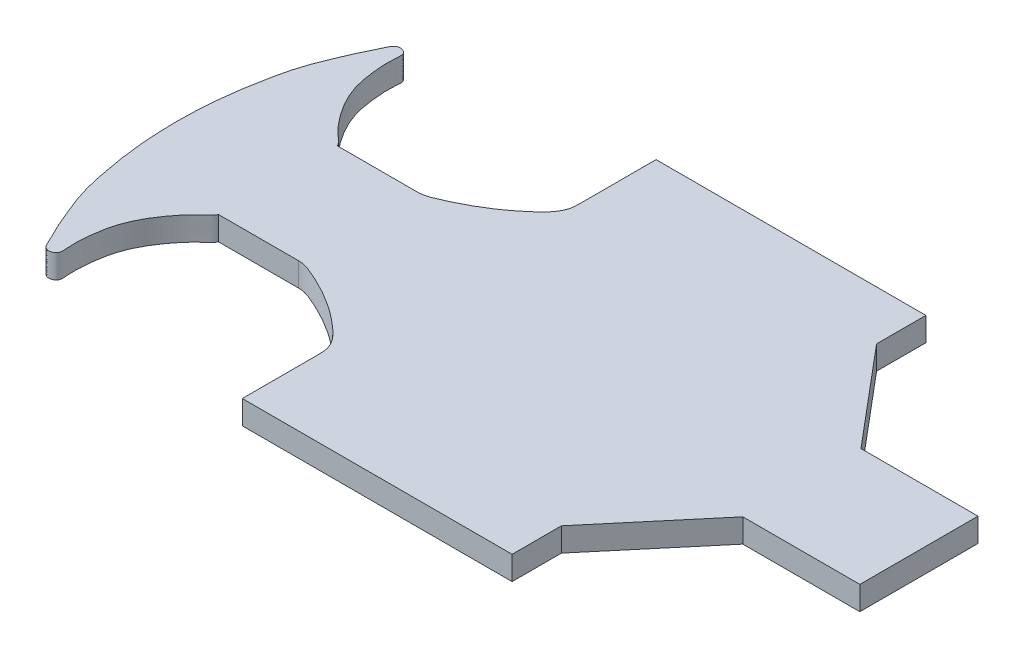
ISO-10303-21;
HEADER;
FILE_DESCRIPTION(('STEP AP214'),'2;1');
FILE_NAME('part.step','',(''),(''),'','','');
FILE_SCHEMA(('AUTOMOTIVE_DESIGN { 1 0 10303 214 1 1 1 1 }'));
ENDSEC;
DATA;
#1=APPLICATION_CONTEXT('core data for automotive mechanical design processes');
#2=APPLICATION_PROTOCOL_DEFINITION('international standard','automotive_design',2000,#1);
#3=PRODUCT_CONTEXT('',#1,'mechanical');
#4=PRODUCT('Part','Part','',(#3));
#5=PRODUCT_RELATED_PRODUCT_CATEGORY('part','',(#4));
#6=PRODUCT_DEFINITION_FORMATION('','',#4);
#7=PRODUCT_DEFINITION_CONTEXT('part definition',#1,'design');
#8=PRODUCT_DEFINITION('design','',#6,#7);
#9=PRODUCT_DEFINITION_SHAPE('','',#8);
#10=(LENGTH_UNIT() NAMED_UNIT(*) SI_UNIT(.MILLI.,.METRE.));
#11=(NAMED_UNIT(*) PLANE_ANGLE_UNIT() SI_UNIT($,.RADIAN.));
#12=(NAMED_UNIT(*) SI_UNIT($,.STERADIAN.) SOLID_ANGLE_UNIT());
#13=UNCERTAINTY_MEASURE_WITH_UNIT(LENGTH_MEASURE(1.E-05),#10,'distance_accuracy_value','');
#14=(GEOMETRIC_REPRESENTATION_CONTEXT(3) GLOBAL_UNCERTAINTY_ASSIGNED_CONTEXT((#13)) GLOBAL_UNIT_ASSIGNED_CONTEXT((#10,
#11,#12)) REPRESENTATION_CONTEXT('',''));
#15=CARTESIAN_POINT('',(0.,0.,0.));
#16=DIRECTION('',(0.,0.,1.));
#17=DIRECTION('',(1.,0.,0.));
#18=AXIS2_PLACEMENT_3D('',#15,#16,#17);
#19=CARTESIAN_POINT('',(115.068930171489,10.,-83.5105271816987));
#20=CARTESIAN_POINT('',(115.068930171489,10.,-85.4523260025491));
#21=CARTESIAN_POINT('',(115.147023327499,10.,-89.2239037065916));
#22=CARTESIAN_POINT('',(111.903352503153,10.,-94.3936841806615));
#23=CARTESIAN_POINT('',(106.742467778179,10.,-99.0321688142349));
#24=CARTESIAN_POINT('',(97.8943490032046,10.,-106.039765726452));
#25=CARTESIAN_POINT('',(87.4355017362749,10.,-111.618593277351));
#26=CARTESIAN_POINT('',(79.2126361652634,10.,-114.920441654248));
#27=CARTESIAN_POINT('',(76.4993979676328,10.,-114.920441654248));
#28=B_SPLINE_CURVE_WITH_KNOTS('',3,(#19,#20,#21,#22,#23,#24,#25,#26,#27),.UNSPECIFIED.,.F.,.F.,
(4,1,1,1,1,1,4),(0.,0.105978477751694,0.213108663044497,0.330387254989374,0.501050906937181,
0.851333825241986,1.),.UNSPECIFIED.);
#29=DIRECTION('',(0.,-1.,0.));
#30=VECTOR('',#29,1.);
#31=SURFACE_OF_LINEAR_EXTRUSION('',#28,#30);
#32=CARTESIAN_POINT('',(115.068930171489,0.,-83.5105271816987));
#33=CARTESIAN_POINT('',(115.068930171489,0.,-85.4523260025491));
#34=CARTESIAN_POINT('',(115.147023327499,0.,-89.2239037065916));
#35=CARTESIAN_POINT('',(111.903352503153,0.,-94.3936841806615));
#36=CARTESIAN_POINT('',(106.742467778179,0.,-99.0321688142349));
#37=CARTESIAN_POINT('',(97.8943490032046,0.,-106.039765726452));
#38=CARTESIAN_POINT('',(87.4355017362749,0.,-111.618593277351));
#39=CARTESIAN_POINT('',(79.2126361652634,0.,-114.920441654248));
#40=CARTESIAN_POINT('',(76.4993979676328,0.,-114.920441654248));
#41=B_SPLINE_CURVE_WITH_KNOTS('',3,(#32,#33,#34,#35,#36,#37,#38,#39,#40),.UNSPECIFIED.,.F.,.F.,
(4,1,1,1,1,1,4),(0.,0.105978477751694,0.213108663044497,0.330387254989374,0.501050906937181,
0.851333825241986,1.),.UNSPECIFIED.);
#42=CARTESIAN_POINT('',(115.068930171489,0.,-83.5105271816987));
#43=VERTEX_POINT('',#42);
#44=CARTESIAN_POINT('',(76.4993979676328,0.,-114.920441654248));
#45=VERTEX_POINT('',#44);
#46=EDGE_CURVE('E302',#43,#45,#41,.T.);
#47=ORIENTED_EDGE('',*,*,#46,.F.);
#48=DIRECTION('',(0.,-1.,0.));
#49=VECTOR('',#48,1.);
#50=CARTESIAN_POINT('',(115.068930171489,10.,-83.5105271816987));
#51=LINE('',#50,#49);
#52=CARTESIAN_POINT('',(115.068930171489,10.,-83.5105271816987));
#53=VERTEX_POINT('',#52);
#54=EDGE_CURVE('E11',#53,#43,#51,.T.);
#55=ORIENTED_EDGE('',*,*,#54,.F.);
#56=CARTESIAN_POINT('',(76.4993979676328,10.,-114.920441654248));
#57=VERTEX_POINT('',#56);
#58=EDGE_CURVE('E361',#53,#57,#28,.T.);
#59=ORIENTED_EDGE('',*,*,#58,.T.);
#60=DIRECTION('',(0.,-1.,0.));
#61=VECTOR('',#60,1.);
#62=CARTESIAN_POINT('',(76.4993979676328,10.,-114.920441654248));
#63=LINE('',#62,#61);
#64=EDGE_CURVE('E118',#57,#45,#63,.T.);
#65=ORIENTED_EDGE('',*,*,#64,.T.);
#66=EDGE_LOOP('',(#47,#55,#59,#65));
#67=FACE_BOUND('',#66,.T.);
#68=ADVANCED_FACE('F39',(#67),#31,.T.);
#69=CARTESIAN_POINT('',(115.068930171489,10.,0.));
#70=DIRECTION('',(1.,0.,0.));
#71=DIRECTION('',(0.,0.,-1.));
#72=AXIS2_PLACEMENT_3D('',#69,#70,#71);
#73=PLANE('',#72);
#74=DIRECTION('',(0.,0.,1.));
#75=VECTOR('',#74,1.);
#76=CARTESIAN_POINT('',(115.068930171489,0.,0.));
#77=LINE('',#76,#75);
#78=CARTESIAN_POINT('',(115.068930171489,0.,-52.6656046921163));
#79=VERTEX_POINT('',#78);
#80=EDGE_CURVE('E292',#43,#79,#77,.T.);
#81=ORIENTED_EDGE('',*,*,#80,.T.);
#82=DIRECTION('',(0.,-1.,0.));
#83=VECTOR('',#82,1.);
#84=CARTESIAN_POINT('',(115.068930171489,10.,-52.6656046921163));
#85=LINE('',#84,#83);
#86=CARTESIAN_POINT('',(115.068930171489,10.,-52.6656046921163));
#87=VERTEX_POINT('',#86);
#88=EDGE_CURVE('E49',#87,#79,#85,.T.);
#89=ORIENTED_EDGE('',*,*,#88,.F.);
#90=DIRECTION('',(0.,0.,1.));
#91=VECTOR('',#90,1.);
#92=CARTESIAN_POINT('',(115.068930171489,10.,0.));
#93=LINE('',#92,#91);
#94=EDGE_CURVE('E365',#53,#87,#93,.T.);
#95=ORIENTED_EDGE('',*,*,#94,.F.);
#96=ORIENTED_EDGE('',*,*,#54,.T.);
#97=EDGE_LOOP('',(#81,#89,#95,#96));
#98=FACE_BOUND('',#97,.T.);
#99=ADVANCED_FACE('F429',(#98),#73,.F.);
#100=CARTESIAN_POINT('',(0.,10.,-52.6656046921163));
#101=DIRECTION('',(0.,0.,-1.));
#102=DIRECTION('',(-1.,0.,0.));
#103=AXIS2_PLACEMENT_3D('',#100,#101,#102);
#104=PLANE('',#103);
#105=DIRECTION('',(1.,0.,0.));
#106=VECTOR('',#105,1.);
#107=CARTESIAN_POINT('',(0.,0.,-52.6656046921163));
#108=LINE('',#107,#106);
#109=CARTESIAN_POINT('',(228.993139750254,0.,-52.6656046921163));
#110=VERTEX_POINT('',#109);
#111=EDGE_CURVE('E284',#79,#110,#108,.T.);
#112=ORIENTED_EDGE('',*,*,#111,.T.);
#113=DIRECTION('',(0.,-1.,0.));
#114=VECTOR('',#113,1.);
#115=CARTESIAN_POINT('',(228.993139750254,10.,-52.6656046921163));
#116=LINE('',#115,#114);
#117=CARTESIAN_POINT('',(228.993139750254,10.,-52.6656046921163));
#118=VERTEX_POINT('',#117);
#119=EDGE_CURVE('E273',#118,#110,#116,.T.);
#120=ORIENTED_EDGE('',*,*,#119,.F.);
#121=DIRECTION('',(1.,0.,0.));
#122=VECTOR('',#121,1.);
#123=CARTESIAN_POINT('',(0.,10.,-52.6656046921163));
#124=LINE('',#123,#122);
#125=EDGE_CURVE('E286',#87,#118,#124,.T.);
#126=ORIENTED_EDGE('',*,*,#125,.F.);
#127=ORIENTED_EDGE('',*,*,#88,.T.);
#128=EDGE_LOOP('',(#112,#120,#126,#127));
#129=FACE_BOUND('',#128,.T.);
#130=ADVANCED_FACE('F282',(#129),#104,.F.);
#131=CARTESIAN_POINT('',(228.993139750254,10.,0.));
#132=DIRECTION('',(1.,0.,0.));
#133=DIRECTION('',(0.,0.,-1.));
#134=AXIS2_PLACEMENT_3D('',#131,#132,#133);
#135=PLANE('',#134);
#136=DIRECTION('',(0.,0.,1.));
#137=VECTOR('',#136,1.);
#138=CARTESIAN_POINT('',(228.993139750254,0.,0.));
#139=LINE('',#138,#137);
#140=CARTESIAN_POINT('',(228.993139750254,0.,-73.488076502795));
#141=VERTEX_POINT('',#140);
#142=EDGE_CURVE('E295',#141,#110,#139,.T.);
#143=ORIENTED_EDGE('',*,*,#142,.F.);
#144=DIRECTION('',(0.,-1.,0.));
#145=VECTOR('',#144,1.);
#146=CARTESIAN_POINT('',(228.993139750254,10.,-73.488076502795));
#147=LINE('',#146,#145);
#148=CARTESIAN_POINT('',(228.993139750254,10.,-73.488076502795));
#149=VERTEX_POINT('',#148);
#150=EDGE_CURVE('E270',#149,#141,#147,.T.);
#151=ORIENTED_EDGE('',*,*,#150,.F.);
#152=DIRECTION('',(0.,0.,1.));
#153=VECTOR('',#152,1.);
#154=CARTESIAN_POINT('',(228.993139750254,10.,0.));
#155=LINE('',#154,#153);
#156=EDGE_CURVE('E377',#149,#118,#155,.T.);
#157=ORIENTED_EDGE('',*,*,#156,.T.);
#158=ORIENTED_EDGE('',*,*,#119,.T.);
#159=EDGE_LOOP('',(#143,#151,#157,#158));
#160=FACE_BOUND('',#159,.T.);
#161=ADVANCED_FACE('F436',(#160),#135,.T.);
#162=CARTESIAN_POINT('',(97.836235825649,10.,82.344257267305));
#163=DIRECTION('',(0.765081287440528,0.,0.643933710569919));
#164=DIRECTION('',(0.643933710569919,0.,-0.765081287440528));
#165=AXIS2_PLACEMENT_3D('',#162,#163,#164);
#166=PLANE('',#165);
#167=DIRECTION('',(-0.643933710569919,0.,0.765081287440528));
#168=VECTOR('',#167,1.);
#169=CARTESIAN_POINT('',(97.836235825649,0.,82.344257267305));
#170=LINE('',#169,#168);
#171=CARTESIAN_POINT('',(263.996116630017,0.,-115.076398679184));
#172=VERTEX_POINT('',#171);
#173=EDGE_CURVE('E300',#172,#141,#170,.T.);
#174=ORIENTED_EDGE('',*,*,#173,.F.);
#175=DIRECTION('',(0.,-1.,0.));
#176=VECTOR('',#175,1.);
#177=CARTESIAN_POINT('',(263.996116630017,10.,-115.076398679184));
#178=LINE('',#177,#176);
#179=CARTESIAN_POINT('',(263.996116630017,10.,-115.076398679184));
#180=VERTEX_POINT('',#179);
#181=EDGE_CURVE('E267',#180,#172,#178,.T.);
#182=ORIENTED_EDGE('',*,*,#181,.F.);
#183=DIRECTION('',(-0.643933710569919,0.,0.765081287440528));
#184=VECTOR('',#183,1.);
#185=CARTESIAN_POINT('',(97.836235825649,10.,82.344257267305));
#186=LINE('',#185,#184);
#187=EDGE_CURVE('E381',#180,#149,#186,.T.);
#188=ORIENTED_EDGE('',*,*,#187,.T.);
#189=ORIENTED_EDGE('',*,*,#150,.T.);
#190=EDGE_LOOP('',(#174,#182,#188,#189));
#191=FACE_BOUND('',#190,.T.);
#192=ADVANCED_FACE('F441',(#191),#166,.T.);
#193=CARTESIAN_POINT('',(0.,10.,-115.076398679184));
#194=DIRECTION('',(0.,0.,1.));
#195=DIRECTION('',(1.,0.,0.));
#196=AXIS2_PLACEMENT_3D('',#193,#194,#195);
#197=PLANE('',#196);
#198=DIRECTION('',(-1.,0.,0.));
#199=VECTOR('',#198,1.);
#200=CARTESIAN_POINT('',(0.,0.,-115.076398679184));
#201=LINE('',#200,#199);
#202=CARTESIAN_POINT('',(313.415648674237,0.,-115.076398679184));
#203=VERTEX_POINT('',#202);
#204=EDGE_CURVE('E307',#203,#172,#201,.T.);
#205=ORIENTED_EDGE('',*,*,#204,.F.);
#206=DIRECTION('',(0.,-1.,0.));
#207=VECTOR('',#206,1.);
#208=CARTESIAN_POINT('',(313.415648674237,10.,-115.076398679184));
#209=LINE('',#208,#207);
#210=CARTESIAN_POINT('',(313.415648674237,10.,-115.076398679184));
#211=VERTEX_POINT('',#210);
#212=EDGE_CURVE('E264',#211,#203,#209,.T.);
#213=ORIENTED_EDGE('',*,*,#212,.F.);
#214=DIRECTION('',(-1.,0.,0.));
#215=VECTOR('',#214,1.);
#216=CARTESIAN_POINT('',(0.,10.,-115.076398679184));
#217=LINE('',#216,#215);
#218=EDGE_CURVE('E385',#211,#180,#217,.T.);
#219=ORIENTED_EDGE('',*,*,#218,.T.);
#220=ORIENTED_EDGE('',*,*,#181,.T.);
#221=EDGE_LOOP('',(#205,#213,#219,#220));
#222=FACE_BOUND('',#221,.T.);
#223=ADVANCED_FACE('F445',(#222),#197,.T.);
#224=CARTESIAN_POINT('',(313.415648674237,10.,0.));
#225=DIRECTION('',(1.,0.,0.));
#226=DIRECTION('',(0.,0.,-1.));
#227=AXIS2_PLACEMENT_3D('',#224,#225,#226);
#228=PLANE('',#227);
#229=DIRECTION('',(0.,0.,1.));
#230=VECTOR('',#229,1.);
#231=CARTESIAN_POINT('',(313.415648674237,0.,0.));
#232=LINE('',#231,#230);
#233=CARTESIAN_POINT('',(313.415648674237,0.,-164.966398679184));
#234=VERTEX_POINT('',#233);
#235=EDGE_CURVE('E311',#234,#203,#232,.T.);
#236=ORIENTED_EDGE('',*,*,#235,.F.);
#237=DIRECTION('',(0.,-1.,0.));
#238=VECTOR('',#237,1.);
#239=CARTESIAN_POINT('',(313.415648674237,10.,-164.966398679184));
#240=LINE('',#239,#238);
#241=CARTESIAN_POINT('',(313.415648674237,10.,-164.966398679184));
#242=VERTEX_POINT('',#241);
#243=EDGE_CURVE('E261',#242,#234,#240,.T.);
#244=ORIENTED_EDGE('',*,*,#243,.F.);
#245=DIRECTION('',(0.,0.,1.));
#246=VECTOR('',#245,1.);
#247=CARTESIAN_POINT('',(313.415648674237,10.,0.));
#248=LINE('',#247,#246);
#249=EDGE_CURVE('E389',#242,#211,#248,.T.);
#250=ORIENTED_EDGE('',*,*,#249,.T.);
#251=ORIENTED_EDGE('',*,*,#212,.T.);
#252=EDGE_LOOP('',(#236,#244,#250,#251));
#253=FACE_BOUND('',#252,.T.);
#254=ADVANCED_FACE('F449',(#253),#228,.T.);
#255=CARTESIAN_POINT('',(0.,10.,-164.966398679184));
#256=DIRECTION('',(0.,0.,1.));
#257=DIRECTION('',(1.,0.,0.));
#258=AXIS2_PLACEMENT_3D('',#255,#256,#257);
#259=PLANE('',#258);
#260=DIRECTION('',(-1.,0.,0.));
#261=VECTOR('',#260,1.);
#262=CARTESIAN_POINT('',(0.,0.,-164.966398679184));
#263=LINE('',#262,#261);
#264=CARTESIAN_POINT('',(263.996116630017,0.,-164.966398679184));
#265=VERTEX_POINT('',#264);
#266=EDGE_CURVE('E315',#234,#265,#263,.T.);
#267=ORIENTED_EDGE('',*,*,#266,.T.);
#268=DIRECTION('',(0.,-1.,0.));
#269=VECTOR('',#268,1.);
#270=CARTESIAN_POINT('',(263.996116630017,10.,-164.966398679184));
#271=LINE('',#270,#269);
#272=CARTESIAN_POINT('',(263.996116630017,10.,-164.966398679184));
#273=VERTEX_POINT('',#272);
#274=EDGE_CURVE('E257',#273,#265,#271,.T.);
#275=ORIENTED_EDGE('',*,*,#274,.F.);
#276=DIRECTION('',(-1.,0.,0.));
#277=VECTOR('',#276,1.);
#278=CARTESIAN_POINT('',(0.,10.,-164.966398679184));
#279=LINE('',#278,#277);
#280=EDGE_CURVE('E393',#242,#273,#279,.T.);
#281=ORIENTED_EDGE('',*,*,#280,.F.);
#282=ORIENTED_EDGE('',*,*,#243,.T.);
#283=EDGE_LOOP('',(#267,#275,#281,#282));
#284=FACE_BOUND('',#283,.T.);
#285=ADVANCED_FACE('F453',(#284),#259,.F.);
#286=CARTESIAN_POINT('',(235.802577488655,10.,-198.464177828978));
#287=DIRECTION('',(-0.765081287440528,0.,0.643933710569919));
#288=DIRECTION('',(0.643933710569919,0.,0.765081287440528));
#289=AXIS2_PLACEMENT_3D('',#286,#287,#288);
#290=PLANE('',#289);
#291=DIRECTION('',(-0.643933710569919,0.,-0.765081287440528));
#292=VECTOR('',#291,1.);
#293=CARTESIAN_POINT('',(235.802577488655,0.,-198.464177828978));
#294=LINE('',#293,#292);
#295=CARTESIAN_POINT('',(228.993139750254,0.,-206.554720855574));
#296=VERTEX_POINT('',#295);
#297=EDGE_CURVE('E318',#265,#296,#294,.T.);
#298=ORIENTED_EDGE('',*,*,#297,.T.);
#299=DIRECTION('',(0.,-1.,0.));
#300=VECTOR('',#299,1.);
#301=CARTESIAN_POINT('',(228.993139750254,10.,-206.554720855574));
#302=LINE('',#301,#300);
#303=CARTESIAN_POINT('',(228.993139750254,10.,-206.554720855574));
#304=VERTEX_POINT('',#303);
#305=EDGE_CURVE('E253',#304,#296,#302,.T.);
#306=ORIENTED_EDGE('',*,*,#305,.F.);
#307=DIRECTION('',(-0.643933710569919,0.,-0.765081287440528));
#308=VECTOR('',#307,1.);
#309=CARTESIAN_POINT('',(235.802577488655,10.,-198.464177828978));
#310=LINE('',#309,#308);
#311=EDGE_CURVE('E396',#273,#304,#310,.T.);
#312=ORIENTED_EDGE('',*,*,#311,.F.);
#313=ORIENTED_EDGE('',*,*,#274,.T.);
#314=EDGE_LOOP('',(#298,#306,#312,#313));
#315=FACE_BOUND('',#314,.T.);
#316=ADVANCED_FACE('F457',(#315),#290,.F.);
#317=CARTESIAN_POINT('',(228.993139750254,10.,0.));
#318=DIRECTION('',(-1.,0.,0.));
#319=DIRECTION('',(0.,0.,1.));
#320=AXIS2_PLACEMENT_3D('',#317,#318,#319);
#321=PLANE('',#320);
#322=DIRECTION('',(0.,0.,-1.));
#323=VECTOR('',#322,1.);
#324=CARTESIAN_POINT('',(228.993139750254,0.,0.));
#325=LINE('',#324,#323);
#326=CARTESIAN_POINT('',(228.993139750254,0.,-227.377192666253));
#327=VERTEX_POINT('',#326);
#328=EDGE_CURVE('E321',#296,#327,#325,.T.);
#329=ORIENTED_EDGE('',*,*,#328,.T.);
#330=DIRECTION('',(0.,-1.,0.));
#331=VECTOR('',#330,1.);
#332=CARTESIAN_POINT('',(228.993139750254,10.,-227.377192666253));
#333=LINE('',#332,#331);
#334=CARTESIAN_POINT('',(228.993139750254,10.,-227.377192666253));
#335=VERTEX_POINT('',#334);
#336=EDGE_CURVE('E250',#335,#327,#333,.T.);
#337=ORIENTED_EDGE('',*,*,#336,.F.);
#338=DIRECTION('',(0.,0.,-1.));
#339=VECTOR('',#338,1.);
#340=CARTESIAN_POINT('',(228.993139750254,10.,0.));
#341=LINE('',#340,#339);
#342=EDGE_CURVE('E399',#304,#335,#341,.T.);
#343=ORIENTED_EDGE('',*,*,#342,.F.);
#344=ORIENTED_EDGE('',*,*,#305,.T.);
#345=EDGE_LOOP('',(#329,#337,#343,#344));
#346=FACE_BOUND('',#345,.T.);
#347=ADVANCED_FACE('F418',(#346),#321,.F.);
#348=CARTESIAN_POINT('',(0.,10.,-227.377192666253));
#349=DIRECTION('',(0.,0.,-1.));
#350=DIRECTION('',(-1.,0.,0.));
#351=AXIS2_PLACEMENT_3D('',#348,#349,#350);
#352=PLANE('',#351);
#353=DIRECTION('',(1.,0.,0.));
#354=VECTOR('',#353,1.);
#355=CARTESIAN_POINT('',(0.,0.,-227.377192666253));
#356=LINE('',#355,#354);
#357=CARTESIAN_POINT('',(115.068930171489,0.,-227.377192666253));
#358=VERTEX_POINT('',#357);
#359=EDGE_CURVE('E325',#358,#327,#356,.T.);
#360=ORIENTED_EDGE('',*,*,#359,.F.);
#361=DIRECTION('',(0.,-1.,0.));
#362=VECTOR('',#361,1.);
#363=CARTESIAN_POINT('',(115.068930171489,10.,-227.377192666253));
#364=LINE('',#363,#362);
#365=CARTESIAN_POINT('',(115.068930171489,10.,-227.377192666253));
#366=VERTEX_POINT('',#365);
#367=EDGE_CURVE('E247',#366,#358,#364,.T.);
#368=ORIENTED_EDGE('',*,*,#367,.F.);
#369=DIRECTION('',(1.,0.,0.));
#370=VECTOR('',#369,1.);
#371=CARTESIAN_POINT('',(0.,10.,-227.377192666253));
#372=LINE('',#371,#370);
#373=EDGE_CURVE('E401',#366,#335,#372,.T.);
#374=ORIENTED_EDGE('',*,*,#373,.T.);
#375=ORIENTED_EDGE('',*,*,#336,.T.);
#376=EDGE_LOOP('',(#360,#368,#374,#375));
#377=FACE_BOUND('',#376,.T.);
#378=ADVANCED_FACE('F420',(#377),#352,.T.);
#379=CARTESIAN_POINT('',(115.068930171489,10.,0.));
#380=DIRECTION('',(-1.,0.,0.));
#381=DIRECTION('',(0.,0.,1.));
#382=AXIS2_PLACEMENT_3D('',#379,#380,#381);
#383=PLANE('',#382);
#384=DIRECTION('',(0.,0.,-1.));
#385=VECTOR('',#384,1.);
#386=CARTESIAN_POINT('',(115.068930171489,0.,0.));
#387=LINE('',#386,#385);
#388=CARTESIAN_POINT('',(115.068930171489,0.,-196.53227017667));
#389=VERTEX_POINT('',#388);
#390=EDGE_CURVE('E329',#389,#358,#387,.T.);
#391=ORIENTED_EDGE('',*,*,#390,.F.);
#392=DIRECTION('',(0.,-1.,0.));
#393=VECTOR('',#392,1.);
#394=CARTESIAN_POINT('',(115.068930171489,10.,-196.53227017667));
#395=LINE('',#394,#393);
#396=CARTESIAN_POINT('',(115.068930171489,10.,-196.53227017667));
#397=VERTEX_POINT('',#396);
#398=EDGE_CURVE('E241',#397,#389,#395,.T.);
#399=ORIENTED_EDGE('',*,*,#398,.F.);
#400=DIRECTION('',(0.,0.,-1.));
#401=VECTOR('',#400,1.);
#402=CARTESIAN_POINT('',(115.068930171489,10.,0.));
#403=LINE('',#402,#401);
#404=EDGE_CURVE('E226',#397,#366,#403,.T.);
#405=ORIENTED_EDGE('',*,*,#404,.T.);
#406=ORIENTED_EDGE('',*,*,#367,.T.);
#407=EDGE_LOOP('',(#391,#399,#405,#406));
#408=FACE_BOUND('',#407,.T.);
#409=ADVANCED_FACE('F217',(#408),#383,.T.);
#410=CARTESIAN_POINT('',(115.068930171489,10.,-196.53227017667));
#411=CARTESIAN_POINT('',(115.068930171489,10.,-194.59047135582));
#412=CARTESIAN_POINT('',(115.147023327499,10.,-190.818893651777));
#413=CARTESIAN_POINT('',(111.903352503153,10.,-185.649113177707));
#414=CARTESIAN_POINT('',(106.742467778179,10.,-181.010628544134));
#415=CARTESIAN_POINT('',(97.8943490032046,10.,-174.003031631917));
#416=CARTESIAN_POINT('',(87.4355017362749,10.,-168.424204081018));
#417=CARTESIAN_POINT('',(79.2126361652634,10.,-165.122355704121));
#418=CARTESIAN_POINT('',(76.4993979676328,10.,-165.122355704121));
#419=B_SPLINE_CURVE_WITH_KNOTS('',3,(#410,#411,#412,#413,#414,#415,#416,#417,#418),
.UNSPECIFIED.,.F.,.F.,(4,1,1,1,1,1,4),(0.,0.105978477751694,0.213108663044497,0.330387254989374,
0.501050906937181,0.851333825241986,1.),.UNSPECIFIED.);
#420=DIRECTION('',(0.,-1.,0.));
#421=VECTOR('',#420,1.);
#422=SURFACE_OF_LINEAR_EXTRUSION('',#419,#421);
#423=CARTESIAN_POINT('',(115.068930171489,0.,-196.53227017667));
#424=CARTESIAN_POINT('',(115.068930171489,0.,-194.59047135582));
#425=CARTESIAN_POINT('',(115.147023327499,0.,-190.818893651777));
#426=CARTESIAN_POINT('',(111.903352503153,0.,-185.649113177707));
#427=CARTESIAN_POINT('',(106.742467778179,0.,-181.010628544134));
#428=CARTESIAN_POINT('',(97.8943490032046,0.,-174.003031631917));
#429=CARTESIAN_POINT('',(87.4355017362749,0.,-168.424204081018));
#430=CARTESIAN_POINT('',(79.2126361652634,0.,-165.122355704121));
#431=CARTESIAN_POINT('',(76.4993979676328,0.,-165.122355704121));
#432=B_SPLINE_CURVE_WITH_KNOTS('',3,(#423,#424,#425,#426,#427,#428,#429,#430,#431),
.UNSPECIFIED.,.F.,.F.,(4,1,1,1,1,1,4),(0.,0.105978477751694,0.213108663044497,0.330387254989374,
0.501050906937181,0.851333825241986,1.),.UNSPECIFIED.);
#433=CARTESIAN_POINT('',(76.4993979676328,0.,-165.122355704121));
#434=VERTEX_POINT('',#433);
#435=EDGE_CURVE('E333',#389,#434,#432,.T.);
#436=ORIENTED_EDGE('',*,*,#435,.T.);
#437=DIRECTION('',(0.,-1.,0.));
#438=VECTOR('',#437,1.);
#439=CARTESIAN_POINT('',(76.4993979676328,10.,-165.122355704121));
#440=LINE('',#439,#438);
#441=CARTESIAN_POINT('',(76.4993979676328,10.,-165.122355704121));
#442=VERTEX_POINT('',#441);
#443=EDGE_CURVE('E234',#442,#434,#440,.T.);
#444=ORIENTED_EDGE('',*,*,#443,.F.);
#445=EDGE_CURVE('E220',#397,#442,#419,.T.);
#446=ORIENTED_EDGE('',*,*,#445,.F.);
#447=ORIENTED_EDGE('',*,*,#398,.T.);
#448=EDGE_LOOP('',(#436,#444,#446,#447));
#449=FACE_BOUND('',#448,.T.);
#450=ADVANCED_FACE('F212',(#449),#422,.F.);
#451=CARTESIAN_POINT('',(0.,10.,-165.122355704121));
#452=DIRECTION('',(0.,0.,-1.));
#453=DIRECTION('',(-1.,0.,0.));
#454=AXIS2_PLACEMENT_3D('',#451,#452,#453);
#455=PLANE('',#454);
#456=DIRECTION('',(1.,0.,0.));
#457=VECTOR('',#456,1.);
#458=CARTESIAN_POINT('',(0.,0.,-165.122355704121));
#459=LINE('',#458,#457);
#460=CARTESIAN_POINT('',(42.7196265865985,0.,-165.122355704121));
#461=VERTEX_POINT('',#460);
#462=EDGE_CURVE('E237',#461,#434,#459,.T.);
#463=ORIENTED_EDGE('',*,*,#462,.F.);
#464=DIRECTION('',(0.,-1.,0.));
#465=VECTOR('',#464,1.);
#466=CARTESIAN_POINT('',(42.7196265865985,10.,-165.122355704121));
#467=LINE('',#466,#465);
#468=CARTESIAN_POINT('',(42.7196265865985,10.,-165.122355704121));
#469=VERTEX_POINT('',#468);
#470=EDGE_CURVE('E183',#469,#461,#467,.T.);
#471=ORIENTED_EDGE('',*,*,#470,.F.);
#472=DIRECTION('',(1.,0.,0.));
#473=VECTOR('',#472,1.);
#474=CARTESIAN_POINT('',(0.,10.,-165.122355704121));
#475=LINE('',#474,#473);
#476=EDGE_CURVE('E170',#469,#442,#475,.T.);
#477=ORIENTED_EDGE('',*,*,#476,.T.);
#478=ORIENTED_EDGE('',*,*,#443,.T.);
#479=EDGE_LOOP('',(#463,#471,#477,#478));
#480=FACE_BOUND('',#479,.T.);
#481=ADVANCED_FACE('F209',(#480),#455,.T.);
#482=CARTESIAN_POINT('',(42.7196265865985,10.,-165.122355704121));
#483=CARTESIAN_POINT('',(42.4041127978172,10.,-165.810644028677));
#484=CARTESIAN_POINT('',(41.5392816271648,10.,-167.018758838064));
#485=CARTESIAN_POINT('',(40.1167347582916,10.,-168.13078808221));
#486=CARTESIAN_POINT('',(37.0355233964152,10.,-170.824062732586));
#487=CARTESIAN_POINT('',(34.3366317205889,10.,-174.000709140539));
#488=CARTESIAN_POINT('',(30.3114820606529,10.,-179.496744200793));
#489=CARTESIAN_POINT('',(27.4231809266191,10.,-184.355378837233));
#490=CARTESIAN_POINT('',(24.8561827758774,10.,-190.831933343042));
#491=CARTESIAN_POINT('',(23.2237681473631,10.,-198.993026596554));
#492=CARTESIAN_POINT('',(22.6603042740224,10.,-206.003436668767));
#493=CARTESIAN_POINT('',(23.2673247411527,10.,-211.401987236275));
#494=CARTESIAN_POINT('',(22.9265262551899,10.,-213.211630386506));
#495=CARTESIAN_POINT('',(21.1836550362477,10.,-214.269772466538));
#496=CARTESIAN_POINT('',(19.3675880733963,10.,-214.293125184581));
#497=CARTESIAN_POINT('',(17.7824269835035,10.,-213.221416526918));
#498=CARTESIAN_POINT('',(17.1810869372945,10.,-211.74820022815));
#499=CARTESIAN_POINT('',(16.1852274502006,10.,-209.758746026292));
#500=CARTESIAN_POINT('',(14.8143378948493,10.,-206.659764108069));
#501=CARTESIAN_POINT('',(12.8408808269837,10.,-202.940619664726));
#502=CARTESIAN_POINT('',(10.9078392352671,10.,-198.186617474666));
#503=CARTESIAN_POINT('',(8.31948366016167,10.,-192.219580851456));
#504=CARTESIAN_POINT('',(5.45227937152754,10.,-184.28545861718));
#505=CARTESIAN_POINT('',(3.54615310700973,10.,-175.416826953556));
#506=CARTESIAN_POINT('',(1.65873722389837,10.,-165.354418798201));
#507=CARTESIAN_POINT('',(0.26449361026909,10.,-153.657635728433));
#508=CARTESIAN_POINT('',(-0.0971324045633202,10.,-144.618243964466));
#509=CARTESIAN_POINT('',(-0.108569766809403,10.,-140.021399802989));
#510=B_SPLINE_CURVE_WITH_KNOTS('',3,(#482,#483,#484,#485,#486,#487,#488,#489,#490,#491,#492,
#493,#494,#495,#496,#497,#498,#499,#500,#501,#502,#503,#504,#505,#506,#507,#508,#509),
.UNSPECIFIED.,.F.,.F.,(4,1,1,1,1,1,1,1,1,1,1,1,1,1,1,1,1,1,1,1,1,1,1,1,1,4),(0.,
0.015948201135273,0.0307675804530836,0.0379024367869845,0.102219368946791,0.117832931927673,
0.18156054559134,0.220663534468255,0.263999691524146,0.356798401877169,0.366273577533485,
0.379280405134548,0.392773654437176,0.405525279224983,0.415666571979696,0.431026605478402,
0.438086696845082,0.462725634879041,0.502301629043808,0.526763070861646,0.570809921840894,
0.63944497461662,0.704068595141303,0.76172003643474,0.855228419365934,0.952059587687333),.UNSPECIFIED.);
#511=DIRECTION('',(0.,-1.,0.));
#512=VECTOR('',#511,1.);
#513=SURFACE_OF_LINEAR_EXTRUSION('',#510,#512);
#514=CARTESIAN_POINT('',(42.7196265865985,0.,-165.122355704121));
#515=CARTESIAN_POINT('',(42.4041127978172,0.,-165.810644028677));
#516=CARTESIAN_POINT('',(41.5392816271648,0.,-167.018758838064));
#517=CARTESIAN_POINT('',(40.1167347582916,0.,-168.13078808221));
#518=CARTESIAN_POINT('',(37.0355233964152,0.,-170.824062732586));
#519=CARTESIAN_POINT('',(34.3366317205889,0.,-174.000709140539));
#520=CARTESIAN_POINT('',(30.3114820606529,0.,-179.496744200793));
#521=CARTESIAN_POINT('',(27.4231809266191,0.,-184.355378837233));
#522=CARTESIAN_POINT('',(24.8561827758774,0.,-190.831933343042));
#523=CARTESIAN_POINT('',(23.2237681473631,0.,-198.993026596554));
#524=CARTESIAN_POINT('',(22.6603042740224,0.,-206.003436668767));
#525=CARTESIAN_POINT('',(23.2673247411527,0.,-211.401987236275));
#526=CARTESIAN_POINT('',(22.9265262551899,0.,-213.211630386506));
#527=CARTESIAN_POINT('',(21.1836550362477,0.,-214.269772466538));
#528=CARTESIAN_POINT('',(19.3675880733963,0.,-214.293125184581));
#529=CARTESIAN_POINT('',(17.7824269835035,0.,-213.221416526918));
#530=CARTESIAN_POINT('',(17.1810869372945,0.,-211.74820022815));
#531=CARTESIAN_POINT('',(16.1852274502006,0.,-209.758746026292));
#532=CARTESIAN_POINT('',(14.8143378948493,0.,-206.659764108069));
#533=CARTESIAN_POINT('',(12.8408808269837,0.,-202.940619664726));
#534=CARTESIAN_POINT('',(10.9078392352671,0.,-198.186617474666));
#535=CARTESIAN_POINT('',(8.31948366016167,0.,-192.219580851456));
#536=CARTESIAN_POINT('',(5.45227937152754,0.,-184.28545861718));
#537=CARTESIAN_POINT('',(3.54615310700973,0.,-175.416826953556));
#538=CARTESIAN_POINT('',(1.65873722389837,0.,-165.354418798201));
#539=CARTESIAN_POINT('',(0.26449361026909,0.,-153.657635728433));
#540=CARTESIAN_POINT('',(-0.0971324045633202,0.,-144.618243964466));
#541=CARTESIAN_POINT('',(-0.108569766809403,0.,-140.021399802989));
#542=B_SPLINE_CURVE_WITH_KNOTS('',3,(#514,#515,#516,#517,#518,#519,#520,#521,#522,#523,#524,
#525,#526,#527,#528,#529,#530,#531,#532,#533,#534,#535,#536,#537,#538,#539,#540,#541),
.UNSPECIFIED.,.F.,.F.,(4,1,1,1,1,1,1,1,1,1,1,1,1,1,1,1,1,1,1,1,1,1,1,1,1,4),(0.,
0.015948201135273,0.0307675804530836,0.0379024367869845,0.102219368946791,0.117832931927673,
0.18156054559134,0.220663534468255,0.263999691524146,0.356798401877169,0.366273577533485,
0.379280405134548,0.392773654437176,0.405525279224983,0.415666571979696,0.431026605478402,
0.438086696845082,0.462725634879041,0.502301629043808,0.526763070861646,0.570809921840894,
0.63944497461662,0.704068595141303,0.76172003643474,0.855228419365934,0.952059587687333),.UNSPECIFIED.);
#543=CARTESIAN_POINT('',(-0.108569766809403,0.,-140.021399802989));
#544=VERTEX_POINT('',#543);
#545=EDGE_CURVE('E178',#461,#544,#542,.T.);
#546=ORIENTED_EDGE('',*,*,#545,.T.);
#547=DIRECTION('',(0.,-1.,0.));
#548=VECTOR('',#547,1.);
#549=CARTESIAN_POINT('',(-0.108569766809403,10.,-140.021399802989));
#550=LINE('',#549,#548);
#551=CARTESIAN_POINT('',(-0.108569766809403,10.,-140.021399802989));
#552=VERTEX_POINT('',#551);
#553=EDGE_CURVE('E175',#552,#544,#550,.T.);
#554=ORIENTED_EDGE('',*,*,#553,.F.);
#555=EDGE_CURVE('E164',#469,#552,#510,.T.);
#556=ORIENTED_EDGE('',*,*,#555,.F.);
#557=ORIENTED_EDGE('',*,*,#470,.T.);
#558=EDGE_LOOP('',(#546,#554,#556,#557));
#559=FACE_BOUND('',#558,.T.);
#560=ADVANCED_FACE('F176',(#559),#513,.F.);
#561=CARTESIAN_POINT('',(42.7196265865985,10.,-114.920441654248));
#562=CARTESIAN_POINT('',(42.4041127978172,10.,-114.232153329692));
#563=CARTESIAN_POINT('',(41.5392816271648,10.,-113.024038520305));
#564=CARTESIAN_POINT('',(40.1167347582916,10.,-111.912009276159));
#565=CARTESIAN_POINT('',(37.0355233964152,10.,-109.218734625783));
#566=CARTESIAN_POINT('',(34.3366317205889,10.,-106.042088217829));
#567=CARTESIAN_POINT('',(30.3114820606529,10.,-100.546053157575));
#568=CARTESIAN_POINT('',(27.4231809266191,10.,-95.6874185211356));
#569=CARTESIAN_POINT('',(24.8561827758774,10.,-89.2108640153271));
#570=CARTESIAN_POINT('',(23.2237681473631,10.,-81.0497707618154));
#571=CARTESIAN_POINT('',(22.6603042740224,10.,-74.0393606896014));
#572=CARTESIAN_POINT('',(23.2673247411527,10.,-68.640810122094));
#573=CARTESIAN_POINT('',(22.9265262551899,10.,-66.8311669718623));
#574=CARTESIAN_POINT('',(21.1836550362477,10.,-65.7730248918312));
#575=CARTESIAN_POINT('',(19.3675880733963,10.,-65.7496721737879));
#576=CARTESIAN_POINT('',(17.7824269835035,10.,-66.821380831451));
#577=CARTESIAN_POINT('',(17.1810869372945,10.,-68.2945971302188));
#578=CARTESIAN_POINT('',(16.1852274502006,10.,-70.284051332077));
#579=CARTESIAN_POINT('',(14.8143378948493,10.,-73.3830332502999));
#580=CARTESIAN_POINT('',(12.8408808269836,10.,-77.1021776936424));
#581=CARTESIAN_POINT('',(10.9078392352676,10.,-81.8561798837027));
#582=CARTESIAN_POINT('',(8.31948366015673,10.,-87.8232165069129));
#583=CARTESIAN_POINT('',(5.45227937155625,10.,-95.7573387411893));
#584=CARTESIAN_POINT('',(3.54615310691549,10.,-104.625970404813));
#585=CARTESIAN_POINT('',(0.392448325438832,10.,-121.439363258405));
#586=CARTESIAN_POINT('',(-0.385719657599816,10.,-135.548713189377));
#587=CARTESIAN_POINT('',(0.,10.,-146.845547899275));
#588=B_SPLINE_CURVE_WITH_KNOTS('',3,(#561,#562,#563,#564,#565,#566,#567,#568,#569,#570,#571,
#572,#573,#574,#575,#576,#577,#578,#579,#580,#581,#582,#583,#584,#585,#586,#587),.UNSPECIFIED.,
.F.,.F.,(4,1,1,1,1,1,1,1,1,1,1,1,1,1,1,1,1,1,1,1,1,1,1,1,4),(0.,0.015948201135273,
0.0307675804530836,0.0379024367869845,0.102219368946791,0.117832931927673,0.18156054559134,
0.220663534468255,0.263999691524146,0.356798401877169,0.366273577533485,0.379280405134548,
0.392773654437176,0.405525279224983,0.415666571979696,0.431026605478402,0.438086696845082,
0.462725634879041,0.502301629043808,0.526763070861646,0.570809921840894,0.63944497461662,
0.704068595141303,0.76172003643474,1.),.UNSPECIFIED.);
#589=DIRECTION('',(0.,-1.,0.));
#590=VECTOR('',#589,1.);
#591=SURFACE_OF_LINEAR_EXTRUSION('',#588,#590);
#592=CARTESIAN_POINT('',(42.7196265865985,0.,-114.920441654248));
#593=CARTESIAN_POINT('',(42.4041127978172,0.,-114.232153329692));
#594=CARTESIAN_POINT('',(41.5392816271648,0.,-113.024038520305));
#595=CARTESIAN_POINT('',(40.1167347582916,0.,-111.912009276159));
#596=CARTESIAN_POINT('',(37.0355233964152,0.,-109.218734625783));
#597=CARTESIAN_POINT('',(34.3366317205889,0.,-106.042088217829));
#598=CARTESIAN_POINT('',(30.3114820606529,0.,-100.546053157575));
#599=CARTESIAN_POINT('',(27.4231809266191,0.,-95.6874185211356));
#600=CARTESIAN_POINT('',(24.8561827758774,0.,-89.2108640153271));
#601=CARTESIAN_POINT('',(23.2237681473631,0.,-81.0497707618154));
#602=CARTESIAN_POINT('',(22.6603042740224,0.,-74.0393606896014));
#603=CARTESIAN_POINT('',(23.2673247411527,0.,-68.640810122094));
#604=CARTESIAN_POINT('',(22.9265262551899,0.,-66.8311669718623));
#605=CARTESIAN_POINT('',(21.1836550362477,0.,-65.7730248918312));
#606=CARTESIAN_POINT('',(19.3675880733963,0.,-65.7496721737879));
#607=CARTESIAN_POINT('',(17.7824269835035,0.,-66.821380831451));
#608=CARTESIAN_POINT('',(17.1810869372945,0.,-68.2945971302188));
#609=CARTESIAN_POINT('',(16.1852274502006,0.,-70.284051332077));
#610=CARTESIAN_POINT('',(14.8143378948493,0.,-73.3830332502999));
#611=CARTESIAN_POINT('',(12.8408808269836,0.,-77.1021776936424));
#612=CARTESIAN_POINT('',(10.9078392352676,0.,-81.8561798837027));
#613=CARTESIAN_POINT('',(8.31948366015673,0.,-87.8232165069129));
#614=CARTESIAN_POINT('',(5.45227937155625,0.,-95.7573387411893));
#615=CARTESIAN_POINT('',(3.54615310691549,0.,-104.625970404813));
#616=CARTESIAN_POINT('',(0.392448325438832,0.,-121.439363258405));
#617=CARTESIAN_POINT('',(-0.385719657599816,0.,-135.548713189377));
#618=CARTESIAN_POINT('',(0.,0.,-146.845547899275));
#619=B_SPLINE_CURVE_WITH_KNOTS('',3,(#592,#593,#594,#595,#596,#597,#598,#599,#600,#601,#602,
#603,#604,#605,#606,#607,#608,#609,#610,#611,#612,#613,#614,#615,#616,#617,#618),.UNSPECIFIED.,
.F.,.F.,(4,1,1,1,1,1,1,1,1,1,1,1,1,1,1,1,1,1,1,1,1,1,1,1,4),(0.,0.015948201135273,
0.0307675804530836,0.0379024367869845,0.102219368946791,0.117832931927673,0.18156054559134,
0.220663534468255,0.263999691524146,0.356798401877169,0.366273577533485,0.379280405134548,
0.392773654437176,0.405525279224983,0.415666571979696,0.431026605478402,0.438086696845082,
0.462725634879041,0.502301629043808,0.526763070861646,0.570809921840894,0.63944497461662,
0.704068595141303,0.76172003643474,1.),.UNSPECIFIED.);
#620=CARTESIAN_POINT('',(42.7196265865985,0.,-114.920441654248));
#621=VERTEX_POINT('',#620);
#622=EDGE_CURVE('E347',#621,#544,#619,.T.);
#623=ORIENTED_EDGE('',*,*,#622,.F.);
#624=DIRECTION('',(0.,-1.,0.));
#625=VECTOR('',#624,1.);
#626=CARTESIAN_POINT('',(42.7196265865985,10.,-114.920441654248));
#627=LINE('',#626,#625);
#628=CARTESIAN_POINT('',(42.7196265865985,10.,-114.920441654248));
#629=VERTEX_POINT('',#628);
#630=EDGE_CURVE('E111',#629,#621,#627,.T.);
#631=ORIENTED_EDGE('',*,*,#630,.F.);
#632=EDGE_CURVE('E168',#629,#552,#588,.T.);
#633=ORIENTED_EDGE('',*,*,#632,.T.);
#634=ORIENTED_EDGE('',*,*,#553,.T.);
#635=EDGE_LOOP('',(#623,#631,#633,#634));
#636=FACE_BOUND('',#635,.T.);
#637=ADVANCED_FACE('F185',(#636),#591,.T.);
#638=CARTESIAN_POINT('',(0.,10.,-114.920441654248));
#639=DIRECTION('',(0.,0.,-1.));
#640=DIRECTION('',(-1.,0.,0.));
#641=AXIS2_PLACEMENT_3D('',#638,#639,#640);
#642=PLANE('',#641);
#643=DIRECTION('',(1.,0.,0.));
#644=VECTOR('',#643,1.);
#645=CARTESIAN_POINT('',(0.,0.,-114.920441654248));
#646=LINE('',#645,#644);
#647=EDGE_CURVE('E355',#621,#45,#646,.T.);
#648=ORIENTED_EDGE('',*,*,#647,.T.);
#649=ORIENTED_EDGE('',*,*,#64,.F.);
#650=DIRECTION('',(1.,0.,0.));
#651=VECTOR('',#650,1.);
#652=CARTESIAN_POINT('',(0.,10.,-114.920441654248));
#653=LINE('',#652,#651);
#654=EDGE_CURVE('E57',#629,#57,#653,.T.);
#655=ORIENTED_EDGE('',*,*,#654,.F.);
#656=ORIENTED_EDGE('',*,*,#630,.T.);
#657=EDGE_LOOP('',(#648,#649,#655,#656));
#658=FACE_BOUND('',#657,.T.);
#659=ADVANCED_FACE('F205',(#658),#642,.F.);
#660=CARTESIAN_POINT('',(0.,10.,0.));
#661=DIRECTION('',(0.,1.,0.));
#662=DIRECTION('',(0.,0.,1.));
#663=AXIS2_PLACEMENT_3D('',#660,#661,#662);
#664=PLANE('',#663);
#665=ORIENTED_EDGE('',*,*,#58,.F.);
#666=ORIENTED_EDGE('',*,*,#94,.T.);
#667=ORIENTED_EDGE('',*,*,#125,.T.);
#668=ORIENTED_EDGE('',*,*,#156,.F.);
#669=ORIENTED_EDGE('',*,*,#187,.F.);
#670=ORIENTED_EDGE('',*,*,#218,.F.);
#671=ORIENTED_EDGE('',*,*,#249,.F.);
#672=ORIENTED_EDGE('',*,*,#280,.T.);
#673=ORIENTED_EDGE('',*,*,#311,.T.);
#674=ORIENTED_EDGE('',*,*,#342,.T.);
#675=ORIENTED_EDGE('',*,*,#373,.F.);
#676=ORIENTED_EDGE('',*,*,#404,.F.);
#677=ORIENTED_EDGE('',*,*,#445,.T.);
#678=ORIENTED_EDGE('',*,*,#476,.F.);
#679=ORIENTED_EDGE('',*,*,#555,.T.);
#680=ORIENTED_EDGE('',*,*,#632,.F.);
#681=ORIENTED_EDGE('',*,*,#654,.T.);
#682=EDGE_LOOP('',(#665,#666,#667,#668,#669,#670,#671,#672,#673,#674,#675,#676,#677,#678,#679,
#680,#681));
#683=FACE_BOUND('',#682,.T.);
#684=ADVANCED_FACE('F166',(#683),#664,.T.);
#685=CARTESIAN_POINT('',(0.,0.,0.));
#686=DIRECTION('',(0.,1.,0.));
#687=DIRECTION('',(0.,0.,1.));
#688=AXIS2_PLACEMENT_3D('',#685,#686,#687);
#689=PLANE('',#688);
#690=ORIENTED_EDGE('',*,*,#46,.T.);
#691=ORIENTED_EDGE('',*,*,#647,.F.);
#692=ORIENTED_EDGE('',*,*,#622,.T.);
#693=ORIENTED_EDGE('',*,*,#545,.F.);
#694=ORIENTED_EDGE('',*,*,#462,.T.);
#695=ORIENTED_EDGE('',*,*,#435,.F.);
#696=ORIENTED_EDGE('',*,*,#390,.T.);
#697=ORIENTED_EDGE('',*,*,#359,.T.);
#698=ORIENTED_EDGE('',*,*,#328,.F.);
#699=ORIENTED_EDGE('',*,*,#297,.F.);
#700=ORIENTED_EDGE('',*,*,#266,.F.);
#701=ORIENTED_EDGE('',*,*,#235,.T.);
#702=ORIENTED_EDGE('',*,*,#204,.T.);
#703=ORIENTED_EDGE('',*,*,#173,.T.);
#704=ORIENTED_EDGE('',*,*,#142,.T.);
#705=ORIENTED_EDGE('',*,*,#111,.F.);
#706=ORIENTED_EDGE('',*,*,#80,.F.);
#707=EDGE_LOOP('',(#690,#691,#692,#693,#694,#695,#696,#697,#698,#699,#700,#701,#702,#703,#704,
#705,#706));
#708=FACE_BOUND('',#707,.T.);
#709=ADVANCED_FACE('F291',(#708),#689,.F.);
#710=CLOSED_SHELL('',(#68,#99,#130,#161,#192,#223,#254,#285,#316,#347,#378,#409,#450,#481,#560,
#637,#659,#684,#709));
#711=MANIFOLD_SOLID_BREP('B2',#710);
#712=ADVANCED_BREP_SHAPE_REPRESENTATION('',(#18,#711),#14);
#713=SHAPE_DEFINITION_REPRESENTATION(#9,#712);
ENDSEC;
END-ISO-10303-21;
